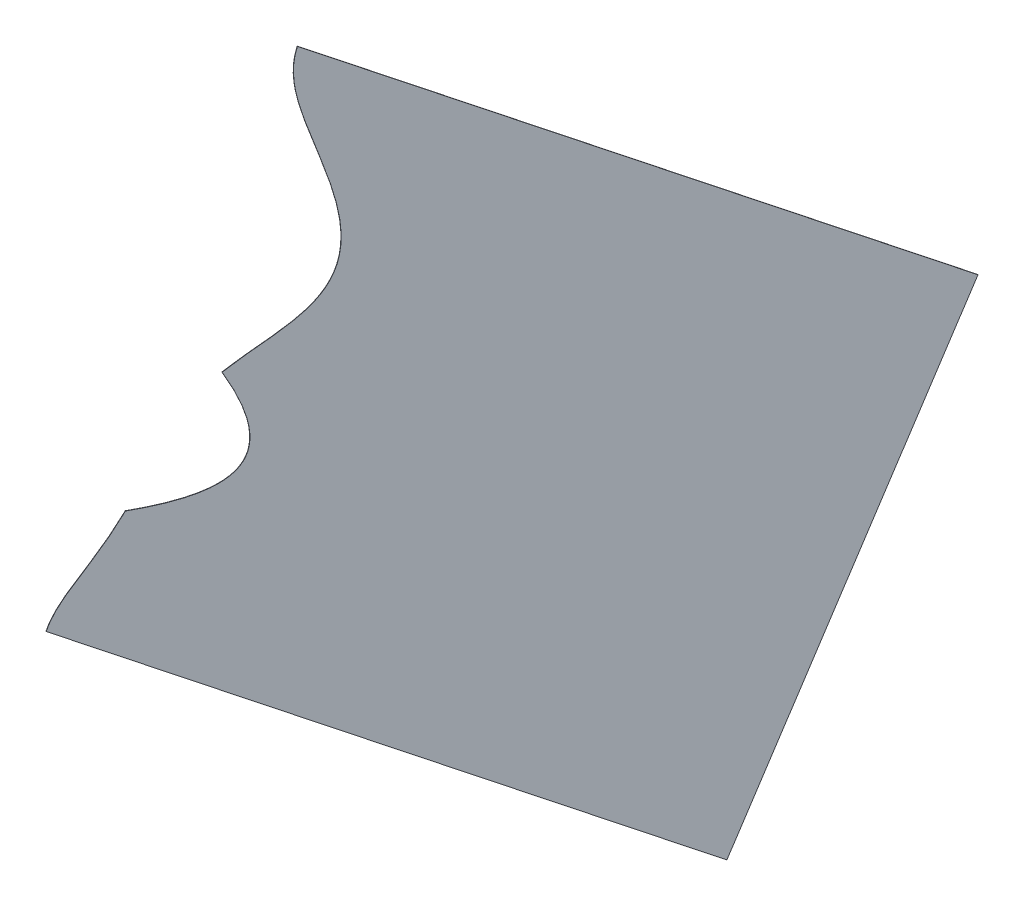
ISO-10303-21;
HEADER;
FILE_DESCRIPTION(('STEP AP214'),'2;1');
FILE_NAME('part.step','',(''),(''),'','','');
FILE_SCHEMA(('AUTOMOTIVE_DESIGN { 1 0 10303 214 1 1 1 1 }'));
ENDSEC;
DATA;
#1=APPLICATION_CONTEXT('core data for automotive mechanical design processes');
#2=APPLICATION_PROTOCOL_DEFINITION('international standard','automotive_design',2000,#1);
#3=PRODUCT_CONTEXT('',#1,'mechanical');
#4=PRODUCT('Part','Part','',(#3));
#5=PRODUCT_RELATED_PRODUCT_CATEGORY('part','',(#4));
#6=PRODUCT_DEFINITION_FORMATION('','',#4);
#7=PRODUCT_DEFINITION_CONTEXT('part definition',#1,'design');
#8=PRODUCT_DEFINITION('design','',#6,#7);
#9=PRODUCT_DEFINITION_SHAPE('','',#8);
#10=(LENGTH_UNIT() NAMED_UNIT(*) SI_UNIT(.MILLI.,.METRE.));
#11=(NAMED_UNIT(*) PLANE_ANGLE_UNIT() SI_UNIT($,.RADIAN.));
#12=(NAMED_UNIT(*) SI_UNIT($,.STERADIAN.) SOLID_ANGLE_UNIT());
#13=UNCERTAINTY_MEASURE_WITH_UNIT(LENGTH_MEASURE(1.E-05),#10,'distance_accuracy_value','');
#14=(GEOMETRIC_REPRESENTATION_CONTEXT(3) GLOBAL_UNCERTAINTY_ASSIGNED_CONTEXT((#13)) GLOBAL_UNIT_ASSIGNED_CONTEXT((#10,
#11,#12)) REPRESENTATION_CONTEXT('',''));
#15=CARTESIAN_POINT('',(0.,0.,0.));
#16=DIRECTION('',(0.,0.,1.));
#17=DIRECTION('',(1.,0.,0.));
#18=AXIS2_PLACEMENT_3D('',#15,#16,#17);
#19=CARTESIAN_POINT('',(771.975212598614,220.128279797104,123.581544742812));
#20=DIRECTION('',(-0.525321839797994,0.457327477904934,0.717557344457126));
#21=DIRECTION('',(0.806880316584485,0.,0.59071495216265));
#22=AXIS2_PLACEMENT_3D('',#19,#20,#21);
#23=PLANE('',#22);
#24=DIRECTION('',(0.0195658106059102,0.849557832951465,-0.527132495228803));
#25=VECTOR('',#24,1.);
#26=CARTESIAN_POINT('',(771.8901447349,220.101992334993,123.536020816148));
#27=LINE('',#26,#25);
#28=CARTESIAN_POINT('',(771.8901447349,220.101992334993,123.536020816148));
#29=VERTEX_POINT('',#28);
#30=CARTESIAN_POINT('',(773.443315898058,287.54150476576,81.6912433498036));
#31=VERTEX_POINT('',#30);
#32=EDGE_CURVE('E176',#29,#31,#27,.T.);
#33=ORIENTED_EDGE('',*,*,#32,.T.);
#34=DIRECTION('',(-0.850678637140127,-0.262874621110375,-0.455239266638427));
#35=VECTOR('',#34,1.);
#36=CARTESIAN_POINT('',(773.528383761772,287.567792227871,81.7367672764674));
#37=LINE('',#36,#35);
#38=CARTESIAN_POINT('',(773.528383761772,287.567792227871,81.7367672764674));
#39=VERTEX_POINT('',#38);
#40=EDGE_CURVE('E13',#39,#31,#37,.T.);
#41=ORIENTED_EDGE('',*,*,#40,.F.);
#42=DIRECTION('',(0.0195658106059102,0.849557832951465,-0.527132495228803));
#43=VECTOR('',#42,1.);
#44=CARTESIAN_POINT('',(771.975212598614,220.128279797104,123.581544742812));
#45=LINE('',#44,#43);
#46=CARTESIAN_POINT('',(771.975212598614,220.128279797104,123.581544742812));
#47=VERTEX_POINT('',#46);
#48=EDGE_CURVE('E156',#47,#39,#45,.T.);
#49=ORIENTED_EDGE('',*,*,#48,.F.);
#50=DIRECTION('',(-0.850678637140127,-0.262874621110375,-0.455239266638427));
#51=VECTOR('',#50,1.);
#52=CARTESIAN_POINT('',(771.975212598614,220.128279797104,123.581544742812));
#53=LINE('',#52,#51);
#54=EDGE_CURVE('E58',#47,#29,#53,.T.);
#55=ORIENTED_EDGE('',*,*,#54,.T.);
#56=EDGE_LOOP('',(#33,#41,#49,#55));
#57=FACE_BOUND('',#56,.T.);
#58=ADVANCED_FACE('F42',(#57),#23,.F.);
#59=CARTESIAN_POINT('',(773.528383761772,287.567792227871,81.7367672764674));
#60=DIRECTION('',(-0.0195658106059086,-0.849557832951465,0.527132495228803));
#61=DIRECTION('',(0.,-0.527233422887537,-0.849720493921555));
#62=AXIS2_PLACEMENT_3D('',#59,#60,#61);
#63=PLANE('',#62);
#64=DIRECTION('',(-0.525321839797993,0.457327477904933,0.717557344457127));
#65=VECTOR('',#64,1.);
#66=CARTESIAN_POINT('',(773.443315898058,287.54150476576,81.6912433498036));
#67=LINE('',#66,#65);
#68=CARTESIAN_POINT('',(723.73112490444,330.819261763226,149.595040706188));
#69=VERTEX_POINT('',#68);
#70=EDGE_CURVE('E174',#31,#69,#67,.T.);
#71=ORIENTED_EDGE('',*,*,#70,.T.);
#72=DIRECTION('',(-0.850678637140127,-0.262874621110375,-0.455239266638427));
#73=VECTOR('',#72,1.);
#74=CARTESIAN_POINT('',(723.816192768153,330.845549225337,149.640564632851));
#75=LINE('',#74,#73);
#76=CARTESIAN_POINT('',(723.816192768153,330.845549225337,149.640564632851));
#77=VERTEX_POINT('',#76);
#78=EDGE_CURVE('E50',#77,#69,#75,.T.);
#79=ORIENTED_EDGE('',*,*,#78,.F.);
#80=DIRECTION('',(-0.525321839797993,0.457327477904933,0.717557344457127));
#81=VECTOR('',#80,1.);
#82=CARTESIAN_POINT('',(773.528383761772,287.567792227871,81.7367672764674));
#83=LINE('',#82,#81);
#84=EDGE_CURVE('E91',#39,#77,#83,.T.);
#85=ORIENTED_EDGE('',*,*,#84,.F.);
#86=ORIENTED_EDGE('',*,*,#40,.T.);
#87=EDGE_LOOP('',(#71,#79,#85,#86));
#88=FACE_BOUND('',#87,.T.);
#89=ADVANCED_FACE('F146',(#88),#63,.F.);
#90=CARTESIAN_POINT('',(723.816192768153,330.845549225337,149.640564632851));
#91=CARTESIAN_POINT('',(723.839218923644,330.150265751005,149.999023433019));
#92=CARTESIAN_POINT('',(723.944892326426,329.254060509333,150.319065041373));
#93=CARTESIAN_POINT('',(723.994663949827,328.894213009388,150.433851094053));
#94=CARTESIAN_POINT('',(724.081161120091,328.346887924106,150.588267869258));
#95=CARTESIAN_POINT('',(724.228302380113,327.594153549387,150.747974736255));
#96=CARTESIAN_POINT('',(724.442923867546,326.661914278408,150.885239105328));
#97=CARTESIAN_POINT('',(724.748715110062,325.545986951768,150.958209295246));
#98=CARTESIAN_POINT('',(725.139381218026,324.281318121922,150.958468559295));
#99=CARTESIAN_POINT('',(725.637950855566,322.831117614188,150.864228817863));
#100=CARTESIAN_POINT('',(725.923216095346,322.055837660661,150.778850371386));
#101=CARTESIAN_POINT('',(726.164867672841,321.399088791031,150.706525273904));
#102=CARTESIAN_POINT('',(726.462895644057,320.621409267426,150.598683481975));
#103=CARTESIAN_POINT('',(726.698801996808,320.005831007189,150.513320474924));
#104=CARTESIAN_POINT('',(727.012739691887,319.203613315446,150.389918512596));
#105=CARTESIAN_POINT('',(727.167746195572,318.807518926207,150.328988885387));
#106=CARTESIAN_POINT('',(727.567509691759,317.791491738073,150.168672082017));
#107=CARTESIAN_POINT('',(727.920127283833,316.895289198373,150.027262159119));
#108=CARTESIAN_POINT('',(728.122996440885,316.375414465119,149.948370492381));
#109=CARTESIAN_POINT('',(728.429969990148,315.588760671322,149.828994756328));
#110=CARTESIAN_POINT('',(728.675469888399,314.945847883598,149.741488984523));
#111=CARTESIAN_POINT('',(728.967409288703,314.181319771642,149.637430356696));
#112=CARTESIAN_POINT('',(729.494038442359,312.751540241937,149.47896551446));
#113=CARTESIAN_POINT('',(729.999494836798,311.304918367446,149.369790442688));
#114=CARTESIAN_POINT('',(730.476205526823,309.835162720849,149.327689194441));
#115=CARTESIAN_POINT('',(730.909547016892,308.350762230416,149.375085958937));
#116=CARTESIAN_POINT('',(731.284280974519,306.858605452158,149.53647795814));
#117=CARTESIAN_POINT('',(731.581549768426,305.370836667157,149.840090702736));
#118=CARTESIAN_POINT('',(731.780544275001,303.911506841454,150.310920912391));
#119=CARTESIAN_POINT('',(731.862842578508,302.516692896784,150.962560171784));
#120=CARTESIAN_POINT('',(731.821838819145,301.216738728274,151.789830596898));
#121=CARTESIAN_POINT('',(731.662651464031,300.032808445792,152.770946549448));
#122=CARTESIAN_POINT('',(731.402938706507,298.972327043756,153.868623700771));
#123=CARTESIAN_POINT('',(731.06485223503,298.028414338612,155.045441415711));
#124=CARTESIAN_POINT('',(730.670177138216,297.182714465836,156.271290651479));
#125=CARTESIAN_POINT('',(730.234334960725,296.411558301033,157.531021646195));
#126=CARTESIAN_POINT('',(729.985764016312,296.02701619849,158.217562493253));
#127=CARTESIAN_POINT('',(729.775139785218,295.701178096765,158.799296365523));
#128=CARTESIAN_POINT('',(729.513345954277,295.329308688506,159.503228281329));
#129=CARTESIAN_POINT('',(729.313650770537,295.045648338136,160.040184453145));
#130=CARTESIAN_POINT('',(729.027815161753,294.656279985478,160.799146453185));
#131=CARTESIAN_POINT('',(728.944342432912,294.542572532936,161.020786540294));
#132=CARTESIAN_POINT('',(728.615159593898,294.096555428878,161.893460352098));
#133=CARTESIAN_POINT('',(728.534729213512,293.987043518888,162.106992697264));
#134=CARTESIAN_POINT('',(728.248678626785,293.597564494223,162.866420320594));
#135=CARTESIAN_POINT('',(728.047838742099,293.31302071406,163.406025657368));
#136=CARTESIAN_POINT('',(727.787827698685,292.944645053553,164.104608744419));
#137=CARTESIAN_POINT('',(727.575045779662,292.618592446987,164.690498424509));
#138=CARTESIAN_POINT('',(727.329368744373,292.242133591377,165.366963982638));
#139=CARTESIAN_POINT('',(727.120874507586,291.883113034618,165.963878629384));
#140=B_SPLINE_CURVE_WITH_KNOTS('',2,(#90,#91,#92,#93,#94,#95,#96,#97,#98,#99,#100,#101,#102,
#103,#104,#105,#106,#107,#108,#109,#110,#111,#112,#113,#114,#115,#116,#117,#118,#119,#120,#121,
#122,#123,#124,#125,#126,#127,#128,#129,#130,#131,#132,#133,#134,#135,#136,#137,#138,#139),
.UNSPECIFIED.,.F.,.F.,(3,1,1,1,1,1,1,1,1,2,2,2,2,2,2,1,1,1,1,1,1,1,1,1,1,1,1,1,1,2,2,2,1,2,2,2,
3),(0.,0.03125,0.0390625,0.046875,0.0625,0.0780143737792969,0.101507186889648,0.125,0.15625,
0.1875,0.21875,0.25,0.28125,0.3125,0.34375,0.375,0.40625,0.4375,0.46875,0.5,0.53125,0.5625,
0.59375,0.625,0.65625,0.6875,0.71875,0.75,0.78125,0.8125,0.84375,0.875,0.890625,0.90625,0.9375,
0.96875,1.),.UNSPECIFIED.);
#141=DIRECTION('',(-0.850678637140127,-0.262874621110375,-0.455239266638427));
#142=VECTOR('',#141,1.);
#143=SURFACE_OF_LINEAR_EXTRUSION('',#140,#142);
#144=CARTESIAN_POINT('',(723.73112490444,330.819261763226,149.595040706188));
#145=CARTESIAN_POINT('',(723.75415105993,330.123978288894,149.953499506355));
#146=CARTESIAN_POINT('',(723.859824462712,329.227773047222,150.273541114709));
#147=CARTESIAN_POINT('',(723.909596086113,328.867925547277,150.388327167389));
#148=CARTESIAN_POINT('',(723.996093256377,328.320600461995,150.542743942594));
#149=CARTESIAN_POINT('',(724.143234516399,327.567866087276,150.702450809591));
#150=CARTESIAN_POINT('',(724.357856003832,326.635626816297,150.839715178664));
#151=CARTESIAN_POINT('',(724.663647246348,325.519699489656,150.912685368582));
#152=CARTESIAN_POINT('',(725.054313354312,324.255030659811,150.912944632631));
#153=CARTESIAN_POINT('',(725.552882991852,322.804830152077,150.8187048912));
#154=CARTESIAN_POINT('',(725.838148231632,322.02955019855,150.733326444722));
#155=CARTESIAN_POINT('',(726.079799809127,321.37280132892,150.66100134724));
#156=CARTESIAN_POINT('',(726.377827780343,320.595121805315,150.553159555311));
#157=CARTESIAN_POINT('',(726.613734133094,319.979543545078,150.46779654826));
#158=CARTESIAN_POINT('',(726.927671828173,319.177325853335,150.344394585933));
#159=CARTESIAN_POINT('',(727.082678331858,318.781231464096,150.283464958723));
#160=CARTESIAN_POINT('',(727.482441828045,317.765204275962,150.123148155353));
#161=CARTESIAN_POINT('',(727.835059420119,316.869001736262,149.981738232455));
#162=CARTESIAN_POINT('',(728.037928577171,316.349127003008,149.902846565717));
#163=CARTESIAN_POINT('',(728.344902126434,315.562473209211,149.783470829664));
#164=CARTESIAN_POINT('',(728.590402024685,314.919560421487,149.695965057859));
#165=CARTESIAN_POINT('',(728.882341424989,314.155032309531,149.591906430032));
#166=CARTESIAN_POINT('',(729.408970578645,312.725252779826,149.433441587796));
#167=CARTESIAN_POINT('',(729.914426973084,311.278630905335,149.324266516024));
#168=CARTESIAN_POINT('',(730.391137663109,309.808875258737,149.282165267777));
#169=CARTESIAN_POINT('',(730.824479153178,308.324474768305,149.329562032274));
#170=CARTESIAN_POINT('',(731.199213110805,306.832317990047,149.490954031476));
#171=CARTESIAN_POINT('',(731.496481904712,305.344549205046,149.794566776072));
#172=CARTESIAN_POINT('',(731.695476411287,303.885219379343,150.265396985728));
#173=CARTESIAN_POINT('',(731.777774714794,302.490405434673,150.91703624512));
#174=CARTESIAN_POINT('',(731.736770955431,301.190451266163,151.744306670234));
#175=CARTESIAN_POINT('',(731.577583600317,300.006520983681,152.725422622784));
#176=CARTESIAN_POINT('',(731.317870842793,298.946039581645,153.823099774107));
#177=CARTESIAN_POINT('',(730.979784371317,298.002126876501,154.999917489047));
#178=CARTESIAN_POINT('',(730.585109274502,297.156427003725,156.225766724815));
#179=CARTESIAN_POINT('',(730.149267097011,296.385270838922,157.485497719531));
#180=CARTESIAN_POINT('',(729.900696152598,296.000728736379,158.17203856659));
#181=CARTESIAN_POINT('',(729.690071921504,295.674890634654,158.753772438859));
#182=CARTESIAN_POINT('',(729.428278090563,295.303021226395,159.457704354665));
#183=CARTESIAN_POINT('',(729.228582906823,295.019360876025,159.994660526482));
#184=CARTESIAN_POINT('',(728.942747298039,294.629992523367,160.753622526521));
#185=CARTESIAN_POINT('',(728.859274569198,294.516285070825,160.97526261363));
#186=CARTESIAN_POINT('',(728.530091730184,294.070267966767,161.847936425434));
#187=CARTESIAN_POINT('',(728.449661349798,293.960756056777,162.0614687706));
#188=CARTESIAN_POINT('',(728.163610763071,293.571277032112,162.82089639393));
#189=CARTESIAN_POINT('',(727.962770878385,293.286733251949,163.360501730704));
#190=CARTESIAN_POINT('',(727.702759834971,292.918357591442,164.059084817756));
#191=CARTESIAN_POINT('',(727.489977915948,292.592304984876,164.644974497845));
#192=CARTESIAN_POINT('',(727.244300880659,292.215846129266,165.321440055975));
#193=CARTESIAN_POINT('',(727.035806643872,291.856825572507,165.918354702721));
#194=B_SPLINE_CURVE_WITH_KNOTS('',2,(#144,#145,#146,#147,#148,#149,#150,#151,#152,#153,#154,
#155,#156,#157,#158,#159,#160,#161,#162,#163,#164,#165,#166,#167,#168,#169,#170,#171,#172,#173,
#174,#175,#176,#177,#178,#179,#180,#181,#182,#183,#184,#185,#186,#187,#188,#189,#190,#191,#192,
#193),.UNSPECIFIED.,.F.,.F.,(3,1,1,1,1,1,1,1,1,2,2,2,2,2,2,1,1,1,1,1,1,1,1,1,1,1,1,1,1,2,2,2,1,
2,2,2,3),(0.,0.03125,0.0390625,0.046875,0.0625,0.0780143737792969,0.101507186889648,0.125,
0.15625,0.1875,0.21875,0.25,0.28125,0.3125,0.34375,0.375,0.40625,0.4375,0.46875,0.5,0.53125,
0.5625,0.59375,0.625,0.65625,0.6875,0.71875,0.75,0.78125,0.8125,0.84375,0.875,0.890625,0.90625,
0.9375,0.96875,1.),.UNSPECIFIED.);
#195=CARTESIAN_POINT('',(727.035806787299,291.856825819484,165.918354292091));
#196=VERTEX_POINT('',#195);
#197=EDGE_CURVE('E172',#69,#196,#194,.T.);
#198=ORIENTED_EDGE('',*,*,#197,.T.);
#199=DIRECTION('',(-0.850678637140127,-0.262874621110375,-0.455239266638427));
#200=VECTOR('',#199,1.);
#201=CARTESIAN_POINT('',(727.120874651013,291.883113281595,165.963878218755));
#202=LINE('',#201,#200);
#203=CARTESIAN_POINT('',(727.120874651013,291.883113281595,165.963878218755));
#204=VERTEX_POINT('',#203);
#205=EDGE_CURVE('E119',#204,#196,#202,.T.);
#206=ORIENTED_EDGE('',*,*,#205,.F.);
#207=EDGE_CURVE('E107',#77,#204,#140,.T.);
#208=ORIENTED_EDGE('',*,*,#207,.F.);
#209=ORIENTED_EDGE('',*,*,#78,.T.);
#210=EDGE_LOOP('',(#198,#206,#208,#209));
#211=FACE_BOUND('',#210,.T.);
#212=ADVANCED_FACE('F144',(#211),#143,.F.);
#213=CARTESIAN_POINT('',(727.120874507586,291.883113034618,165.963878629384));
#214=CARTESIAN_POINT('',(727.939124490004,290.29052600619,165.354491240092));
#215=CARTESIAN_POINT('',(728.599718088487,288.825009515858,164.966331028785));
#216=CARTESIAN_POINT('',(728.673054086181,288.660922875758,164.924043039508));
#217=CARTESIAN_POINT('',(729.435915598037,286.935188342503,164.495041865888));
#218=CARTESIAN_POINT('',(729.926080883555,285.48013045931,164.419311695301));
#219=CARTESIAN_POINT('',(730.254239190598,284.486487982361,164.379873375565));
#220=CARTESIAN_POINT('',(730.445013185627,283.671332563073,164.494090917216));
#221=CARTESIAN_POINT('',(730.664199996605,282.734772437159,164.625319383174));
#222=CARTESIAN_POINT('',(730.809971099521,281.079204504734,165.308921287934));
#223=CARTESIAN_POINT('',(730.629222916423,279.698251456077,166.44409605288));
#224=CARTESIAN_POINT('',(730.388220751363,279.152769393136,167.209427186356));
#225=CARTESIAN_POINT('',(730.176959454523,278.674602535213,167.880312643877));
#226=CARTESIAN_POINT('',(729.847082504018,278.292228570353,168.717533230381));
#227=CARTESIAN_POINT('',(729.559819177125,277.959249812382,169.44660135913));
#228=CARTESIAN_POINT('',(729.149873310028,277.675555426528,170.376460175662));
#229=CARTESIAN_POINT('',(728.541331459721,277.271947483508,171.746666752012));
#230=CARTESIAN_POINT('',(727.712510453121,277.031270832584,173.434412436656));
#231=CARTESIAN_POINT('',(727.634295001444,277.009666670432,173.593044182791));
#232=CARTESIAN_POINT('',(726.935995158633,276.825083490936,175.004501934921));
#233=CARTESIAN_POINT('',(726.079835655196,276.746237056863,176.649885760381));
#234=CARTESIAN_POINT('',(725.998340044716,276.739327003735,176.806161937915));
#235=CARTESIAN_POINT('',(725.225540309541,276.678705667231,178.285252354123));
#236=CARTESIAN_POINT('',(724.35687384213,276.698240979217,179.897197374394));
#237=B_SPLINE_CURVE_WITH_KNOTS('',2,(#213,#214,#215,#216,#217,#218,#219,#220,#221,#222,#223,
#224,#225,#226,#227,#228,#229,#230,#231,#232,#233,#234,#235,#236),.UNSPECIFIED.,.F.,.F.,(3,1,1,
1,1,1,2,1,1,2,2,1,1,1,1,1,1,1,1,3),(0.,0.11875,0.125,0.13125,0.2440625,0.25,0.3125,0.375,0.4375,
0.5,0.5625,0.625,0.63125,0.7440625,0.75,0.75625,0.8690625,0.875,0.88125,1.),.UNSPECIFIED.);
#238=DIRECTION('',(-0.850678637140127,-0.262874621110375,-0.455239266638427));
#239=VECTOR('',#238,1.);
#240=SURFACE_OF_LINEAR_EXTRUSION('',#237,#239);
#241=CARTESIAN_POINT('',(727.035806643872,291.856825572507,165.918354702721));
#242=CARTESIAN_POINT('',(727.85405662629,290.264238544079,165.308967313428));
#243=CARTESIAN_POINT('',(728.514650224773,288.798722053747,164.920807102121));
#244=CARTESIAN_POINT('',(728.587986222467,288.634635413647,164.878519112844));
#245=CARTESIAN_POINT('',(729.350847734323,286.908900880392,164.449517939224));
#246=CARTESIAN_POINT('',(729.841013019841,285.453842997199,164.373787768637));
#247=CARTESIAN_POINT('',(730.169171326884,284.46020052025,164.334349448901));
#248=CARTESIAN_POINT('',(730.359945321913,283.645045100962,164.448566990552));
#249=CARTESIAN_POINT('',(730.579132132891,282.708484975048,164.57979545651));
#250=CARTESIAN_POINT('',(730.724903235807,281.052917042623,165.26339736127));
#251=CARTESIAN_POINT('',(730.544155052709,279.671963993966,166.398572126216));
#252=CARTESIAN_POINT('',(730.303152887649,279.126481931025,167.163903259692));
#253=CARTESIAN_POINT('',(730.091891590809,278.648315073102,167.834788717213));
#254=CARTESIAN_POINT('',(729.762014640304,278.265941108242,168.672009303717));
#255=CARTESIAN_POINT('',(729.474751313411,277.932962350271,169.401077432466));
#256=CARTESIAN_POINT('',(729.064805446314,277.649267964417,170.330936248998));
#257=CARTESIAN_POINT('',(728.456263596007,277.245660021397,171.701142825349));
#258=CARTESIAN_POINT('',(727.627442589407,277.004983370473,173.388888509992));
#259=CARTESIAN_POINT('',(727.54922713773,276.983379208321,173.547520256127));
#260=CARTESIAN_POINT('',(726.850927294919,276.798796028825,174.958978008257));
#261=CARTESIAN_POINT('',(725.994767791482,276.719949594752,176.604361833717));
#262=CARTESIAN_POINT('',(725.913272181002,276.713039541624,176.760638011251));
#263=CARTESIAN_POINT('',(725.140472445827,276.65241820512,178.239728427459));
#264=CARTESIAN_POINT('',(724.271805978416,276.671953517106,179.85167344773));
#265=B_SPLINE_CURVE_WITH_KNOTS('',2,(#241,#242,#243,#244,#245,#246,#247,#248,#249,#250,#251,
#252,#253,#254,#255,#256,#257,#258,#259,#260,#261,#262,#263,#264),.UNSPECIFIED.,.F.,.F.,(3,1,1,
1,1,1,2,1,1,2,2,1,1,1,1,1,1,1,1,3),(0.,0.11875,0.125,0.13125,0.2440625,0.25,0.3125,0.375,0.4375,
0.5,0.5625,0.625,0.63125,0.7440625,0.75,0.75625,0.8690625,0.875,0.88125,1.),.UNSPECIFIED.);
#266=CARTESIAN_POINT('',(724.271806271131,276.671953510523,179.851672904552));
#267=VERTEX_POINT('',#266);
#268=EDGE_CURVE('E116',#196,#267,#265,.T.);
#269=ORIENTED_EDGE('',*,*,#268,.T.);
#270=DIRECTION('',(-0.850678637140127,-0.262874621110375,-0.455239266638427));
#271=VECTOR('',#270,1.);
#272=CARTESIAN_POINT('',(724.356874134845,276.698240972634,179.897196831216));
#273=LINE('',#272,#271);
#274=CARTESIAN_POINT('',(724.356874134845,276.698240972634,179.897196831216));
#275=VERTEX_POINT('',#274);
#276=EDGE_CURVE('E113',#275,#267,#273,.T.);
#277=ORIENTED_EDGE('',*,*,#276,.F.);
#278=EDGE_CURVE('E100',#204,#275,#237,.T.);
#279=ORIENTED_EDGE('',*,*,#278,.F.);
#280=ORIENTED_EDGE('',*,*,#205,.T.);
#281=EDGE_LOOP('',(#269,#277,#279,#280));
#282=FACE_BOUND('',#281,.T.);
#283=ADVANCED_FACE('F114',(#282),#240,.F.);
#284=CARTESIAN_POINT('',(724.35687384213,276.698240979217,179.897197374394));
#285=CARTESIAN_POINT('',(724.252558766625,275.824283007357,180.59678548184));
#286=CARTESIAN_POINT('',(724.002411603805,274.174053234821,182.017133903291));
#287=CARTESIAN_POINT('',(723.718237343687,272.630680853335,183.439362717392));
#288=CARTESIAN_POINT('',(723.541187633603,271.785509467065,184.258243120157));
#289=CARTESIAN_POINT('',(723.456291738153,271.382642739091,184.649515526049));
#290=CARTESIAN_POINT('',(723.36378346591,270.960584655789,185.066094638592));
#291=CARTESIAN_POINT('',(723.297941669499,270.660189223898,185.362590470279));
#292=CARTESIAN_POINT('',(723.191067089668,270.180921317036,185.839050449103));
#293=CARTESIAN_POINT('',(723.057955838753,269.583997795027,186.432476724018));
#294=CARTESIAN_POINT('',(723.016611609535,269.396838149297,186.617808218259));
#295=CARTESIAN_POINT('',(722.918221995976,268.951441885644,187.058853908156));
#296=CARTESIAN_POINT('',(722.846729464514,268.613784364447,187.387425657436));
#297=CARTESIAN_POINT('',(722.75634526401,268.186901940883,187.802821423387));
#298=CARTESIAN_POINT('',(722.602546528169,267.395978065711,188.546929275756));
#299=CARTESIAN_POINT('',(722.464508846004,266.574626797396,189.279155459266));
#300=CARTESIAN_POINT('',(722.352016262871,265.720637267827,189.982493758025));
#301=CARTESIAN_POINT('',(722.27534306457,264.83027789152,190.63990000012));
#302=CARTESIAN_POINT('',(722.245038347247,263.89286830828,191.237829011517));
#303=CARTESIAN_POINT('',(722.258346000308,263.410107218332,191.491728687814));
#304=B_SPLINE_CURVE_WITH_KNOTS('',2,(#284,#285,#286,#287,#288,#289,#290,#291,#292,#293,#294,
#295,#296,#297,#298,#299,#300,#301,#302,#303),.UNSPECIFIED.,.F.,.F.,(3,1,1,1,1,2,2,2,2,1,1,1,1,
1,3),(0.,0.125,0.25,0.36875,0.375,0.4375,0.5,0.5625,0.625,0.6875,0.75,0.8125,0.875,0.9375,1.),.UNSPECIFIED.);
#305=DIRECTION('',(-0.850678637140127,-0.262874621110375,-0.455239266638427));
#306=VECTOR('',#305,1.);
#307=SURFACE_OF_LINEAR_EXTRUSION('',#304,#306);
#308=CARTESIAN_POINT('',(724.271805978416,276.671953517106,179.85167344773));
#309=CARTESIAN_POINT('',(724.167490902911,275.797995545246,180.551261555176));
#310=CARTESIAN_POINT('',(723.917343740091,274.14776577271,181.971609976627));
#311=CARTESIAN_POINT('',(723.633169479973,272.604393391224,183.393838790728));
#312=CARTESIAN_POINT('',(723.456119769889,271.759222004954,184.212719193493));
#313=CARTESIAN_POINT('',(723.371223874439,271.35635527698,184.603991599385));
#314=CARTESIAN_POINT('',(723.278715602196,270.934297193678,185.020570711928));
#315=CARTESIAN_POINT('',(723.212873805785,270.633901761787,185.317066543615));
#316=CARTESIAN_POINT('',(723.105999225954,270.154633854925,185.793526522439));
#317=CARTESIAN_POINT('',(722.972887975039,269.557710332916,186.386952797355));
#318=CARTESIAN_POINT('',(722.931543745821,269.370550687186,186.572284291595));
#319=CARTESIAN_POINT('',(722.833154132262,268.925154423534,187.013329981492));
#320=CARTESIAN_POINT('',(722.7616616008,268.587496902336,187.341901730772));
#321=CARTESIAN_POINT('',(722.671277400296,268.160614478772,187.757297496723));
#322=CARTESIAN_POINT('',(722.517478664455,267.3696906036,188.501405349092));
#323=CARTESIAN_POINT('',(722.37944098229,266.548339335285,189.233631532603));
#324=CARTESIAN_POINT('',(722.266948399157,265.694349805716,189.936969831361));
#325=CARTESIAN_POINT('',(722.190275200856,264.803990429409,190.594376073456));
#326=CARTESIAN_POINT('',(722.159970483533,263.866580846169,191.192305084853));
#327=CARTESIAN_POINT('',(722.173278136594,263.383819756221,191.446204761151));
#328=B_SPLINE_CURVE_WITH_KNOTS('',2,(#308,#309,#310,#311,#312,#313,#314,#315,#316,#317,#318,
#319,#320,#321,#322,#323,#324,#325,#326,#327),.UNSPECIFIED.,.F.,.F.,(3,1,1,1,1,2,2,2,2,1,1,1,1,
1,3),(0.,0.125,0.25,0.36875,0.375,0.4375,0.5,0.5625,0.625,0.6875,0.75,0.8125,0.875,0.9375,1.),.UNSPECIFIED.);
#329=CARTESIAN_POINT('',(722.173278136594,263.383819756221,191.446204761151));
#330=VERTEX_POINT('',#329);
#331=EDGE_CURVE('E160',#267,#330,#328,.T.);
#332=ORIENTED_EDGE('',*,*,#331,.T.);
#333=DIRECTION('',(-0.850678637140127,-0.262874621110375,-0.455239266638427));
#334=VECTOR('',#333,1.);
#335=CARTESIAN_POINT('',(722.258346000308,263.410107218332,191.491728687814));
#336=LINE('',#335,#334);
#337=CARTESIAN_POINT('',(722.258346000308,263.410107218332,191.491728687814));
#338=VERTEX_POINT('',#337);
#339=EDGE_CURVE('E79',#338,#330,#336,.T.);
#340=ORIENTED_EDGE('',*,*,#339,.F.);
#341=EDGE_CURVE('E105',#275,#338,#304,.T.);
#342=ORIENTED_EDGE('',*,*,#341,.F.);
#343=ORIENTED_EDGE('',*,*,#276,.T.);
#344=EDGE_LOOP('',(#332,#340,#342,#343));
#345=FACE_BOUND('',#344,.T.);
#346=ADVANCED_FACE('F121',(#345),#307,.F.);
#347=CARTESIAN_POINT('',(771.975212598614,220.128279797104,123.581544742812));
#348=DIRECTION('',(-0.019565810605909,-0.849557832951465,0.527132495228803));
#349=DIRECTION('',(0.,-0.527233422887538,-0.849720493921554));
#350=AXIS2_PLACEMENT_3D('',#347,#348,#349);
#351=PLANE('',#350);
#352=DIRECTION('',(-0.525321839797993,0.457327477904934,0.717557344457127));
#353=VECTOR('',#352,1.);
#354=CARTESIAN_POINT('',(771.8901447349,220.101992334993,123.536020816148));
#355=LINE('',#354,#353);
#356=EDGE_CURVE('E157',#29,#330,#355,.T.);
#357=ORIENTED_EDGE('',*,*,#356,.F.);
#358=ORIENTED_EDGE('',*,*,#54,.F.);
#359=DIRECTION('',(-0.525321839797993,0.457327477904934,0.717557344457127));
#360=VECTOR('',#359,1.);
#361=CARTESIAN_POINT('',(771.975212598614,220.128279797104,123.581544742812));
#362=LINE('',#361,#360);
#363=EDGE_CURVE('E122',#47,#338,#362,.T.);
#364=ORIENTED_EDGE('',*,*,#363,.T.);
#365=ORIENTED_EDGE('',*,*,#339,.T.);
#366=EDGE_LOOP('',(#357,#358,#364,#365));
#367=FACE_BOUND('',#366,.T.);
#368=ADVANCED_FACE('F140',(#367),#351,.T.);
#369=CARTESIAN_POINT('',(202.808976721457,-109.98251919538,1377.7688499544));
#370=DIRECTION('',(0.850678637140128,0.262874621110375,0.455239266638426));
#371=DIRECTION('',(0.471833655146552,0.,-0.881687587454334));
#372=AXIS2_PLACEMENT_3D('',#369,#370,#371);
#373=PLANE('',#372);
#374=ORIENTED_EDGE('',*,*,#48,.T.);
#375=ORIENTED_EDGE('',*,*,#84,.T.);
#376=ORIENTED_EDGE('',*,*,#207,.T.);
#377=ORIENTED_EDGE('',*,*,#278,.T.);
#378=ORIENTED_EDGE('',*,*,#341,.T.);
#379=ORIENTED_EDGE('',*,*,#363,.F.);
#380=EDGE_LOOP('',(#374,#375,#376,#377,#378,#379));
#381=FACE_BOUND('',#380,.T.);
#382=ADVANCED_FACE('F102',(#381),#373,.T.);
#383=CARTESIAN_POINT('',(202.723908857743,-110.008806657491,1377.72332602774));
#384=DIRECTION('',(0.850678637140128,0.262874621110375,0.455239266638426));
#385=DIRECTION('',(0.471833655146552,0.,-0.881687587454334));
#386=AXIS2_PLACEMENT_3D('',#383,#384,#385);
#387=PLANE('',#386);
#388=ORIENTED_EDGE('',*,*,#32,.F.);
#389=ORIENTED_EDGE('',*,*,#356,.T.);
#390=ORIENTED_EDGE('',*,*,#331,.F.);
#391=ORIENTED_EDGE('',*,*,#268,.F.);
#392=ORIENTED_EDGE('',*,*,#197,.F.);
#393=ORIENTED_EDGE('',*,*,#70,.F.);
#394=EDGE_LOOP('',(#388,#389,#390,#391,#392,#393));
#395=FACE_BOUND('',#394,.T.);
#396=ADVANCED_FACE('F173',(#395),#387,.F.);
#397=CLOSED_SHELL('',(#58,#89,#212,#283,#346,#368,#382,#396));
#398=MANIFOLD_SOLID_BREP('B2',#397);
#399=ADVANCED_BREP_SHAPE_REPRESENTATION('',(#18,#398),#14);
#400=SHAPE_DEFINITION_REPRESENTATION(#9,#399);
ENDSEC;
END-ISO-10303-21;
